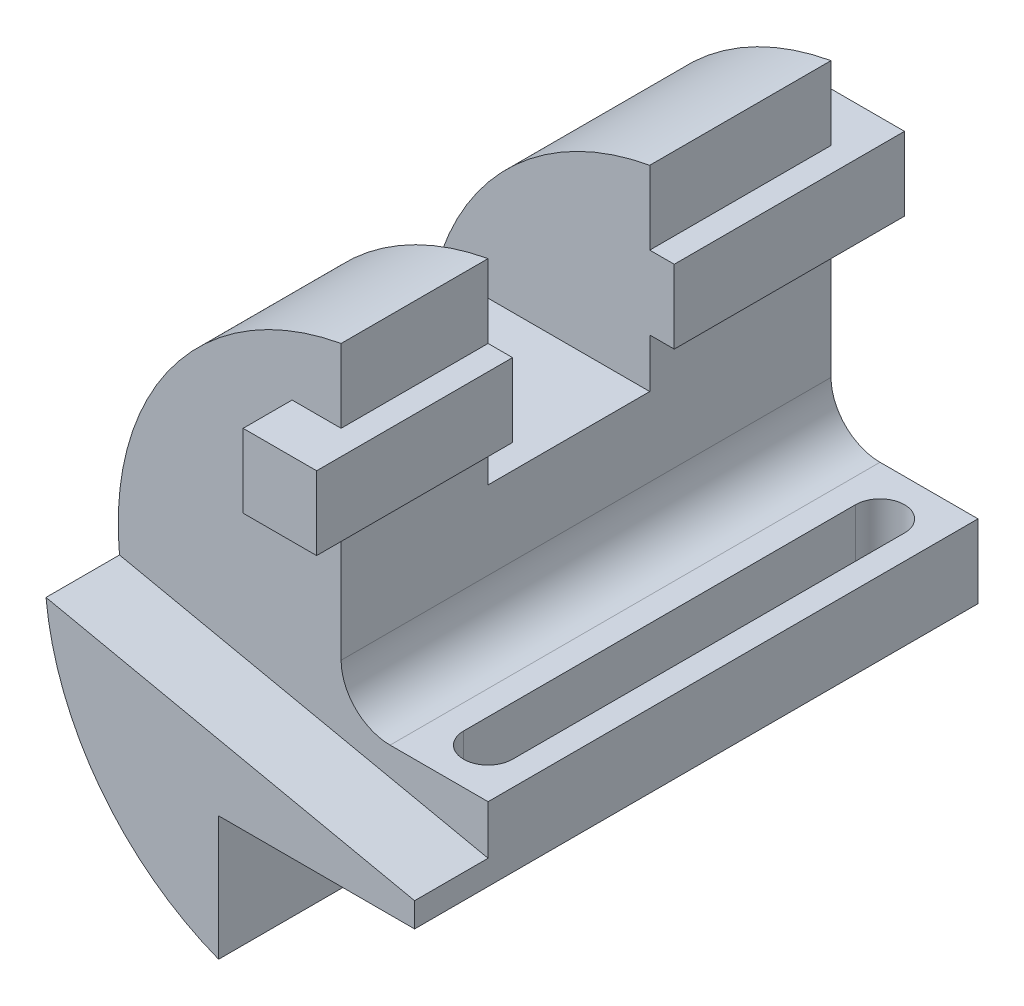
ISO-10303-21;
HEADER;
FILE_DESCRIPTION(('STEP AP214'),'2;1');
FILE_NAME('part.step','',(''),(''),'','','');
FILE_SCHEMA(('AUTOMOTIVE_DESIGN { 1 0 10303 214 1 1 1 1 }'));
ENDSEC;
DATA;
#1=APPLICATION_CONTEXT('core data for automotive mechanical design processes');
#2=APPLICATION_PROTOCOL_DEFINITION('international standard','automotive_design',2000,#1);
#3=PRODUCT_CONTEXT('',#1,'mechanical');
#4=PRODUCT('Part','Part','',(#3));
#5=PRODUCT_RELATED_PRODUCT_CATEGORY('part','',(#4));
#6=PRODUCT_DEFINITION_FORMATION('','',#4);
#7=PRODUCT_DEFINITION_CONTEXT('part definition',#1,'design');
#8=PRODUCT_DEFINITION('design','',#6,#7);
#9=PRODUCT_DEFINITION_SHAPE('','',#8);
#10=(LENGTH_UNIT() NAMED_UNIT(*) SI_UNIT(.MILLI.,.METRE.));
#11=(NAMED_UNIT(*) PLANE_ANGLE_UNIT() SI_UNIT($,.RADIAN.));
#12=(NAMED_UNIT(*) SI_UNIT($,.STERADIAN.) SOLID_ANGLE_UNIT());
#13=UNCERTAINTY_MEASURE_WITH_UNIT(LENGTH_MEASURE(1.E-05),#10,'distance_accuracy_value','');
#14=(GEOMETRIC_REPRESENTATION_CONTEXT(3) GLOBAL_UNCERTAINTY_ASSIGNED_CONTEXT((#13)) GLOBAL_UNIT_ASSIGNED_CONTEXT((#10,
#11,#12)) REPRESENTATION_CONTEXT('',''));
#15=CARTESIAN_POINT('',(0.,0.,0.));
#16=DIRECTION('',(0.,0.,1.));
#17=DIRECTION('',(1.,0.,0.));
#18=AXIS2_PLACEMENT_3D('',#15,#16,#17);
#19=CARTESIAN_POINT('',(-9.99999999999997,0.,-115.));
#20=DIRECTION('',(-1.,0.,0.));
#21=DIRECTION('',(0.,-1.,0.));
#22=AXIS2_PLACEMENT_3D('',#19,#20,#21);
#23=PLANE('',#22);
#24=DIRECTION('',(0.,0.,1.));
#25=VECTOR('',#24,1.);
#26=CARTESIAN_POINT('',(-9.99999999999997,91.362796982157,-115.));
#27=LINE('',#26,#25);
#28=CARTESIAN_POINT('',(-9.99999999999997,91.362796982157,-45.));
#29=VERTEX_POINT('',#28);
#30=CARTESIAN_POINT('',(-9.99999999999997,91.3627969821569,-15.));
#31=VERTEX_POINT('',#30);
#32=EDGE_CURVE('E385',#29,#31,#27,.T.);
#33=ORIENTED_EDGE('',*,*,#32,.F.);
#34=DIRECTION('',(0.,1.,0.));
#35=VECTOR('',#34,1.);
#36=CARTESIAN_POINT('',(-9.99999999999997,0.,-45.));
#37=LINE('',#36,#35);
#38=CARTESIAN_POINT('',(-9.99999999999996,106.362796982157,-45.));
#39=VERTEX_POINT('',#38);
#40=EDGE_CURVE('E315',#29,#39,#37,.T.);
#41=ORIENTED_EDGE('',*,*,#40,.T.);
#42=DIRECTION('',(0.,0.,1.));
#43=VECTOR('',#42,1.);
#44=CARTESIAN_POINT('',(-9.99999999999997,106.362796982157,-115.));
#45=LINE('',#44,#43);
#46=CARTESIAN_POINT('',(-9.99999999999997,106.362796982157,-15.));
#47=VERTEX_POINT('',#46);
#48=EDGE_CURVE('E452',#39,#47,#45,.T.);
#49=ORIENTED_EDGE('',*,*,#48,.T.);
#50=DIRECTION('',(0.,-1.,0.));
#51=VECTOR('',#50,1.);
#52=CARTESIAN_POINT('',(-9.99999999999997,0.,-15.));
#53=LINE('',#52,#51);
#54=EDGE_CURVE('E394',#47,#31,#53,.T.);
#55=ORIENTED_EDGE('',*,*,#54,.T.);
#56=EDGE_LOOP('',(#33,#41,#49,#55));
#57=FACE_BOUND('',#56,.T.);
#58=ADVANCED_FACE('F43',(#57),#23,.F.);
#59=CARTESIAN_POINT('',(-4.99999999999997,91.362796982157,26.2132034355964));
#60=DIRECTION('',(0.,-1.,0.));
#61=DIRECTION('',(1.,0.,0.));
#62=AXIS2_PLACEMENT_3D('',#59,#60,#61);
#63=PLANE('',#62);
#64=DIRECTION('',(0.,0.,-1.));
#65=VECTOR('',#64,1.);
#66=CARTESIAN_POINT('',(-4.99999999999997,91.362796982157,26.2132034355964));
#67=LINE('',#66,#65);
#68=CARTESIAN_POINT('',(-4.99999999999997,91.362796982157,-5.));
#69=VERTEX_POINT('',#68);
#70=CARTESIAN_POINT('',(-4.99999999999997,91.362796982157,-45.));
#71=VERTEX_POINT('',#70);
#72=EDGE_CURVE('E358',#69,#71,#67,.T.);
#73=ORIENTED_EDGE('',*,*,#72,.T.);
#74=DIRECTION('',(-1.,0.,0.));
#75=VECTOR('',#74,1.);
#76=CARTESIAN_POINT('',(-4.99999999999997,91.362796982157,-45.));
#77=LINE('',#76,#75);
#78=EDGE_CURVE('E311',#71,#29,#77,.T.);
#79=ORIENTED_EDGE('',*,*,#78,.T.);
#80=ORIENTED_EDGE('',*,*,#32,.T.);
#81=DIRECTION('',(1.,0.,0.));
#82=VECTOR('',#81,1.);
#83=CARTESIAN_POINT('',(0.,91.362796982157,-15.));
#84=LINE('',#83,#82);
#85=CARTESIAN_POINT('',(-20.,91.3627969821569,-15.));
#86=VERTEX_POINT('',#85);
#87=EDGE_CURVE('E501',#86,#31,#84,.T.);
#88=ORIENTED_EDGE('',*,*,#87,.F.);
#89=DIRECTION('',(0.,0.,-1.));
#90=VECTOR('',#89,1.);
#91=CARTESIAN_POINT('',(-20.,91.3627969821569,26.2132034355964));
#92=LINE('',#91,#90);
#93=CARTESIAN_POINT('',(-20.,91.3627969821569,-5.));
#94=VERTEX_POINT('',#93);
#95=EDGE_CURVE('E364',#94,#86,#92,.T.);
#96=ORIENTED_EDGE('',*,*,#95,.F.);
#97=DIRECTION('',(-1.,0.,0.));
#98=VECTOR('',#97,1.);
#99=CARTESIAN_POINT('',(-4.99999999999997,91.362796982157,-5.));
#100=LINE('',#99,#98);
#101=EDGE_CURVE('E345',#69,#94,#100,.T.);
#102=ORIENTED_EDGE('',*,*,#101,.F.);
#103=EDGE_LOOP('',(#73,#79,#80,#88,#96,#102));
#104=FACE_BOUND('',#103,.T.);
#105=ADVANCED_FACE('F548',(#104),#63,.F.);
#106=CARTESIAN_POINT('',(-4.99999999999997,76.362796982157,26.2132034355964));
#107=DIRECTION('',(0.,1.,0.));
#108=DIRECTION('',(0.,0.,1.));
#109=AXIS2_PLACEMENT_3D('',#106,#107,#108);
#110=PLANE('',#109);
#111=DIRECTION('',(0.,0.,-1.));
#112=VECTOR('',#111,1.);
#113=CARTESIAN_POINT('',(-9.99999999999997,76.362796982157,-115.));
#114=LINE('',#113,#112);
#115=CARTESIAN_POINT('',(-9.99999999999997,76.362796982157,-15.));
#116=VERTEX_POINT('',#115);
#117=CARTESIAN_POINT('',(-9.99999999999997,76.362796982157,-45.));
#118=VERTEX_POINT('',#117);
#119=EDGE_CURVE('E375',#116,#118,#114,.T.);
#120=ORIENTED_EDGE('',*,*,#119,.T.);
#121=DIRECTION('',(1.,0.,0.));
#122=VECTOR('',#121,1.);
#123=CARTESIAN_POINT('',(-4.99999999999997,76.362796982157,-45.));
#124=LINE('',#123,#122);
#125=CARTESIAN_POINT('',(-4.99999999999997,76.362796982157,-45.));
#126=VERTEX_POINT('',#125);
#127=EDGE_CURVE('E303',#118,#126,#124,.T.);
#128=ORIENTED_EDGE('',*,*,#127,.T.);
#129=DIRECTION('',(0.,0.,-1.));
#130=VECTOR('',#129,1.);
#131=CARTESIAN_POINT('',(-4.99999999999997,76.362796982157,26.2132034355964));
#132=LINE('',#131,#130);
#133=CARTESIAN_POINT('',(-4.99999999999997,76.362796982157,-5.));
#134=VERTEX_POINT('',#133);
#135=EDGE_CURVE('E371',#134,#126,#132,.T.);
#136=ORIENTED_EDGE('',*,*,#135,.F.);
#137=DIRECTION('',(1.,0.,0.));
#138=VECTOR('',#137,1.);
#139=CARTESIAN_POINT('',(-4.99999999999997,76.362796982157,-5.));
#140=LINE('',#139,#138);
#141=CARTESIAN_POINT('',(-20.,76.362796982157,-5.));
#142=VERTEX_POINT('',#141);
#143=EDGE_CURVE('E353',#142,#134,#140,.T.);
#144=ORIENTED_EDGE('',*,*,#143,.F.);
#145=DIRECTION('',(0.,0.,-1.));
#146=VECTOR('',#145,1.);
#147=CARTESIAN_POINT('',(-20.,76.362796982157,26.2132034355964));
#148=LINE('',#147,#146);
#149=CARTESIAN_POINT('',(-20.,76.362796982157,-15.));
#150=VERTEX_POINT('',#149);
#151=EDGE_CURVE('E357',#142,#150,#148,.T.);
#152=ORIENTED_EDGE('',*,*,#151,.T.);
#153=DIRECTION('',(-1.,0.,0.));
#154=VECTOR('',#153,1.);
#155=CARTESIAN_POINT('',(0.,76.362796982157,-15.));
#156=LINE('',#155,#154);
#157=EDGE_CURVE('E469',#116,#150,#156,.T.);
#158=ORIENTED_EDGE('',*,*,#157,.F.);
#159=EDGE_LOOP('',(#120,#128,#136,#144,#152,#158));
#160=FACE_BOUND('',#159,.T.);
#161=ADVANCED_FACE('F554',(#160),#110,.F.);
#162=CARTESIAN_POINT('',(-4.99999999999997,91.362796982157,26.2132034355964));
#163=DIRECTION('',(-1.,0.,0.));
#164=DIRECTION('',(0.,-1.,0.));
#165=AXIS2_PLACEMENT_3D('',#162,#163,#164);
#166=PLANE('',#165);
#167=ORIENTED_EDGE('',*,*,#135,.T.);
#168=DIRECTION('',(0.,1.,0.));
#169=VECTOR('',#168,1.);
#170=CARTESIAN_POINT('',(-4.99999999999997,91.362796982157,-45.));
#171=LINE('',#170,#169);
#172=EDGE_CURVE('E12',#126,#71,#171,.T.);
#173=ORIENTED_EDGE('',*,*,#172,.T.);
#174=ORIENTED_EDGE('',*,*,#72,.F.);
#175=DIRECTION('',(0.,1.,0.));
#176=VECTOR('',#175,1.);
#177=CARTESIAN_POINT('',(-4.99999999999997,91.362796982157,-5.));
#178=LINE('',#177,#176);
#179=EDGE_CURVE('E349',#134,#69,#178,.T.);
#180=ORIENTED_EDGE('',*,*,#179,.F.);
#181=EDGE_LOOP('',(#167,#173,#174,#180));
#182=FACE_BOUND('',#181,.T.);
#183=ADVANCED_FACE('F563',(#182),#166,.F.);
#184=CARTESIAN_POINT('',(-9.99999999999997,106.362796982157,-115.));
#185=VERTEX_POINT('',#184);
#186=CARTESIAN_POINT('',(-10.,106.362796982157,-78.));
#187=VERTEX_POINT('',#186);
#188=EDGE_CURVE('E490',#185,#187,#45,.T.);
#189=ORIENTED_EDGE('',*,*,#188,.T.);
#190=DIRECTION('',(0.,-1.,0.));
#191=VECTOR('',#190,1.);
#192=CARTESIAN_POINT('',(-9.99999999999997,0.,-78.));
#193=LINE('',#192,#191);
#194=CARTESIAN_POINT('',(-9.99999999999997,91.362796982157,-78.));
#195=VERTEX_POINT('',#194);
#196=EDGE_CURVE('E299',#187,#195,#193,.T.);
#197=ORIENTED_EDGE('',*,*,#196,.T.);
#198=CARTESIAN_POINT('',(-9.99999999999997,91.362796982157,-115.));
#199=VERTEX_POINT('',#198);
#200=EDGE_CURVE('E386',#199,#195,#27,.T.);
#201=ORIENTED_EDGE('',*,*,#200,.F.);
#202=DIRECTION('',(0.,-1.,0.));
#203=VECTOR('',#202,1.);
#204=CARTESIAN_POINT('',(-9.99999999999997,0.,-115.));
#205=LINE('',#204,#203);
#206=EDGE_CURVE('E429',#185,#199,#205,.T.);
#207=ORIENTED_EDGE('',*,*,#206,.F.);
#208=EDGE_LOOP('',(#189,#197,#201,#207));
#209=FACE_BOUND('',#208,.T.);
#210=ADVANCED_FACE('F45',(#209),#23,.F.);
#211=DIRECTION('',(0.,0.,1.));
#212=VECTOR('',#211,1.);
#213=CARTESIAN_POINT('',(-9.99999999999997,66.3627969821569,-115.));
#214=LINE('',#213,#212);
#215=CARTESIAN_POINT('',(-9.99999999999997,66.362796982157,-78.));
#216=VERTEX_POINT('',#215);
#217=CARTESIAN_POINT('',(-9.99999999999997,66.362796982157,-45.));
#218=VERTEX_POINT('',#217);
#219=EDGE_CURVE('E319',#216,#218,#214,.T.);
#220=ORIENTED_EDGE('',*,*,#219,.T.);
#221=DIRECTION('',(0.,1.,0.));
#222=VECTOR('',#221,1.);
#223=CARTESIAN_POINT('',(-9.99999999999997,0.,-45.));
#224=LINE('',#223,#222);
#225=EDGE_CURVE('E307',#218,#118,#224,.T.);
#226=ORIENTED_EDGE('',*,*,#225,.T.);
#227=ORIENTED_EDGE('',*,*,#119,.F.);
#228=CARTESIAN_POINT('',(-9.99999999999997,50.362796982157,-15.));
#229=VERTEX_POINT('',#228);
#230=EDGE_CURVE('E399',#116,#229,#53,.T.);
#231=ORIENTED_EDGE('',*,*,#230,.T.);
#232=DIRECTION('',(0.,0.,1.));
#233=VECTOR('',#232,1.);
#234=CARTESIAN_POINT('',(-9.99999999999997,50.362796982157,-115.));
#235=LINE('',#234,#233);
#236=CARTESIAN_POINT('',(-9.99999999999997,50.362796982157,-115.));
#237=VERTEX_POINT('',#236);
#238=EDGE_CURVE('E465',#237,#229,#235,.T.);
#239=ORIENTED_EDGE('',*,*,#238,.F.);
#240=CARTESIAN_POINT('',(-9.99999999999997,76.362796982157,-115.));
#241=VERTEX_POINT('',#240);
#242=EDGE_CURVE('E434',#241,#237,#205,.T.);
#243=ORIENTED_EDGE('',*,*,#242,.F.);
#244=CARTESIAN_POINT('',(-9.99999999999997,76.362796982157,-78.));
#245=VERTEX_POINT('',#244);
#246=EDGE_CURVE('E344',#245,#241,#114,.T.);
#247=ORIENTED_EDGE('',*,*,#246,.F.);
#248=DIRECTION('',(0.,-1.,0.));
#249=VECTOR('',#248,1.);
#250=CARTESIAN_POINT('',(-9.99999999999997,0.,-78.));
#251=LINE('',#250,#249);
#252=EDGE_CURVE('E291',#245,#216,#251,.T.);
#253=ORIENTED_EDGE('',*,*,#252,.T.);
#254=EDGE_LOOP('',(#220,#226,#227,#231,#239,#243,#247,#253));
#255=FACE_BOUND('',#254,.T.);
#256=ADVANCED_FACE('F550',(#255),#23,.F.);
#257=CARTESIAN_POINT('',(0.,0.,-115.));
#258=DIRECTION('',(0.,0.,1.));
#259=DIRECTION('',(1.,0.,0.));
#260=AXIS2_PLACEMENT_3D('',#257,#258,#259);
#261=PLANE('',#260);
#262=DIRECTION('',(1.,0.,0.));
#263=VECTOR('',#262,1.);
#264=CARTESIAN_POINT('',(0.,91.362796982157,-115.));
#265=LINE('',#264,#263);
#266=CARTESIAN_POINT('',(-20.,91.3627969821569,-115.));
#267=VERTEX_POINT('',#266);
#268=EDGE_CURVE('E390',#267,#199,#265,.T.);
#269=ORIENTED_EDGE('',*,*,#268,.F.);
#270=DIRECTION('',(0.,1.,0.));
#271=VECTOR('',#270,1.);
#272=CARTESIAN_POINT('',(-20.,0.,-115.));
#273=LINE('',#272,#271);
#274=CARTESIAN_POINT('',(-20.,76.362796982157,-115.));
#275=VERTEX_POINT('',#274);
#276=EDGE_CURVE('E382',#275,#267,#273,.T.);
#277=ORIENTED_EDGE('',*,*,#276,.F.);
#278=DIRECTION('',(-1.,0.,0.));
#279=VECTOR('',#278,1.);
#280=CARTESIAN_POINT('',(0.,76.362796982157,-115.));
#281=LINE('',#280,#279);
#282=EDGE_CURVE('E379',#241,#275,#281,.T.);
#283=ORIENTED_EDGE('',*,*,#282,.F.);
#284=ORIENTED_EDGE('',*,*,#242,.T.);
#285=CARTESIAN_POINT('',(0.,50.362796982157,-115.));
#286=DIRECTION('',(0.,0.,1.));
#287=DIRECTION('',(1.,0.,0.));
#288=AXIS2_PLACEMENT_3D('',#285,#286,#287);
#289=CIRCLE('',#288,10.);
#290=CARTESIAN_POINT('',(0.,40.3627969821569,-115.));
#291=VERTEX_POINT('',#290);
#292=EDGE_CURVE('E449',#237,#291,#289,.T.);
#293=ORIENTED_EDGE('',*,*,#292,.T.);
#294=DIRECTION('',(1.,0.,0.));
#295=VECTOR('',#294,1.);
#296=CARTESIAN_POINT('',(0.,40.3627969821569,-115.));
#297=LINE('',#296,#295);
#298=CARTESIAN_POINT('',(20.,40.3627969821569,-115.));
#299=VERTEX_POINT('',#298);
#300=EDGE_CURVE('E446',#291,#299,#297,.T.);
#301=ORIENTED_EDGE('',*,*,#300,.T.);
#302=DIRECTION('',(0.,-1.,0.));
#303=VECTOR('',#302,1.);
#304=CARTESIAN_POINT('',(20.,0.,-115.));
#305=LINE('',#304,#303);
#306=CARTESIAN_POINT('',(20.,25.3627969821569,-115.));
#307=VERTEX_POINT('',#306);
#308=EDGE_CURVE('E443',#299,#307,#305,.T.);
#309=ORIENTED_EDGE('',*,*,#308,.T.);
#310=DIRECTION('',(-1.,0.,0.));
#311=VECTOR('',#310,1.);
#312=CARTESIAN_POINT('',(0.,25.362796982157,-115.));
#313=LINE('',#312,#311);
#314=CARTESIAN_POINT('',(-20.,25.362796982157,-115.));
#315=VERTEX_POINT('',#314);
#316=EDGE_CURVE('E440',#307,#315,#313,.T.);
#317=ORIENTED_EDGE('',*,*,#316,.T.);
#318=DIRECTION('',(0.,-1.,0.));
#319=VECTOR('',#318,1.);
#320=CARTESIAN_POINT('',(-20.,0.,-115.));
#321=LINE('',#320,#319);
#322=CARTESIAN_POINT('',(-20.,0.,-115.));
#323=VERTEX_POINT('',#322);
#324=EDGE_CURVE('E437',#315,#323,#321,.T.);
#325=ORIENTED_EDGE('',*,*,#324,.T.);
#326=CARTESIAN_POINT('',(0.,51.7711309515255,-115.));
#327=DIRECTION('',(0.,0.,1.));
#328=DIRECTION('',(1.,0.,0.));
#329=AXIS2_PLACEMENT_3D('',#326,#327,#328);
#330=CIRCLE('',#329,55.5);
#331=EDGE_CURVE('E433',#323,#185,#330,.F.);
#332=ORIENTED_EDGE('',*,*,#331,.T.);
#333=ORIENTED_EDGE('',*,*,#206,.T.);
#334=EDGE_LOOP('',(#269,#277,#283,#284,#293,#301,#309,#317,#325,#332,#333));
#335=FACE_BOUND('',#334,.T.);
#336=ADVANCED_FACE('F560',(#335),#261,.F.);
#337=CARTESIAN_POINT('',(0.,0.,-15.));
#338=DIRECTION('',(0.,0.,1.));
#339=DIRECTION('',(1.,0.,0.));
#340=AXIS2_PLACEMENT_3D('',#337,#338,#339);
#341=PLANE('',#340);
#342=DIRECTION('',(0.,1.,0.));
#343=VECTOR('',#342,1.);
#344=CARTESIAN_POINT('',(-20.,0.,-15.));
#345=LINE('',#344,#343);
#346=EDGE_CURVE('E497',#150,#86,#345,.T.);
#347=ORIENTED_EDGE('',*,*,#346,.T.);
#348=ORIENTED_EDGE('',*,*,#87,.T.);
#349=ORIENTED_EDGE('',*,*,#54,.F.);
#350=CARTESIAN_POINT('',(0.,51.7711309515255,-15.));
#351=DIRECTION('',(0.,0.,1.));
#352=DIRECTION('',(1.,0.,0.));
#353=AXIS2_PLACEMENT_3D('',#350,#351,#352);
#354=CIRCLE('',#353,55.5);
#355=CARTESIAN_POINT('',(-55.2350441418964,46.3544992820505,-15.));
#356=VERTEX_POINT('',#355);
#357=EDGE_CURVE('E398',#356,#47,#354,.F.);
#358=ORIENTED_EDGE('',*,*,#357,.F.);
#359=DIRECTION('',(0.978147600733806,-0.207911690817756,0.));
#360=VECTOR('',#359,1.);
#361=CARTESIAN_POINT('',(7.03937648303113,33.1176625540234,-15.));
#362=LINE('',#361,#360);
#363=CARTESIAN_POINT('',(20.,30.362796982157,-15.));
#364=VERTEX_POINT('',#363);
#365=EDGE_CURVE('E403',#356,#364,#362,.T.);
#366=ORIENTED_EDGE('',*,*,#365,.T.);
#367=DIRECTION('',(0.,-1.,0.));
#368=VECTOR('',#367,1.);
#369=CARTESIAN_POINT('',(20.,0.,-15.));
#370=LINE('',#369,#368);
#371=CARTESIAN_POINT('',(20.,40.3627969821569,-15.));
#372=VERTEX_POINT('',#371);
#373=EDGE_CURVE('E407',#372,#364,#370,.T.);
#374=ORIENTED_EDGE('',*,*,#373,.F.);
#375=DIRECTION('',(1.,0.,0.));
#376=VECTOR('',#375,1.);
#377=CARTESIAN_POINT('',(0.,40.3627969821569,-15.));
#378=LINE('',#377,#376);
#379=CARTESIAN_POINT('',(0.,40.3627969821569,-15.));
#380=VERTEX_POINT('',#379);
#381=EDGE_CURVE('E411',#380,#372,#378,.T.);
#382=ORIENTED_EDGE('',*,*,#381,.F.);
#383=CARTESIAN_POINT('',(0.,50.362796982157,-15.));
#384=DIRECTION('',(0.,0.,1.));
#385=DIRECTION('',(1.,0.,0.));
#386=AXIS2_PLACEMENT_3D('',#383,#384,#385);
#387=CIRCLE('',#386,10.);
#388=EDGE_CURVE('E415',#229,#380,#387,.T.);
#389=ORIENTED_EDGE('',*,*,#388,.F.);
#390=ORIENTED_EDGE('',*,*,#230,.F.);
#391=ORIENTED_EDGE('',*,*,#157,.T.);
#392=EDGE_LOOP('',(#347,#348,#349,#358,#366,#374,#382,#389,#390,#391));
#393=FACE_BOUND('',#392,.T.);
#394=ADVANCED_FACE('F609',(#393),#341,.T.);
#395=CARTESIAN_POINT('',(0.,50.362796982157,-115.));
#396=DIRECTION('',(0.,0.,1.));
#397=DIRECTION('',(1.,0.,0.));
#398=AXIS2_PLACEMENT_3D('',#395,#396,#397);
#399=CYLINDRICAL_SURFACE('',#398,10.);
#400=ORIENTED_EDGE('',*,*,#388,.T.);
#401=DIRECTION('',(0.,0.,1.));
#402=VECTOR('',#401,1.);
#403=CARTESIAN_POINT('',(0.,40.3627969821569,-115.));
#404=LINE('',#403,#402);
#405=EDGE_CURVE('E470',#291,#380,#404,.T.);
#406=ORIENTED_EDGE('',*,*,#405,.F.);
#407=ORIENTED_EDGE('',*,*,#292,.F.);
#408=ORIENTED_EDGE('',*,*,#238,.T.);
#409=EDGE_LOOP('',(#400,#406,#407,#408));
#410=FACE_BOUND('',#409,.T.);
#411=ADVANCED_FACE('F615',(#410),#399,.F.);
#412=CARTESIAN_POINT('',(0.,40.3627969821569,-115.));
#413=DIRECTION('',(0.,-1.,0.));
#414=DIRECTION('',(0.,0.,-1.));
#415=AXIS2_PLACEMENT_3D('',#412,#413,#414);
#416=PLANE('',#415);
#417=DIRECTION('',(0.,0.,-1.));
#418=VECTOR('',#417,1.);
#419=CARTESIAN_POINT('',(15.,40.3627969821569,-25.));
#420=LINE('',#419,#418);
#421=CARTESIAN_POINT('',(15.,40.3627969821569,-25.));
#422=VERTEX_POINT('',#421);
#423=CARTESIAN_POINT('',(15.,40.3627969821569,-105.));
#424=VERTEX_POINT('',#423);
#425=EDGE_CURVE('E242',#422,#424,#420,.T.);
#426=ORIENTED_EDGE('',*,*,#425,.F.);
#427=CARTESIAN_POINT('',(9.99999999999997,40.3627969821569,-25.));
#428=DIRECTION('',(0.,1.,0.));
#429=DIRECTION('',(0.,0.,1.));
#430=AXIS2_PLACEMENT_3D('',#427,#428,#429);
#431=CIRCLE('',#430,5.);
#432=CARTESIAN_POINT('',(4.99999999999996,40.3627969821569,-25.));
#433=VERTEX_POINT('',#432);
#434=EDGE_CURVE('E59',#433,#422,#431,.T.);
#435=ORIENTED_EDGE('',*,*,#434,.F.);
#436=DIRECTION('',(0.,0.,1.));
#437=VECTOR('',#436,1.);
#438=CARTESIAN_POINT('',(4.99999999999996,40.3627969821569,-25.));
#439=LINE('',#438,#437);
#440=CARTESIAN_POINT('',(4.99999999999996,40.3627969821569,-105.));
#441=VERTEX_POINT('',#440);
#442=EDGE_CURVE('E250',#441,#433,#439,.T.);
#443=ORIENTED_EDGE('',*,*,#442,.F.);
#444=CARTESIAN_POINT('',(9.99999999999996,40.3627969821569,-105.));
#445=DIRECTION('',(0.,1.,0.));
#446=DIRECTION('',(0.,0.,1.));
#447=AXIS2_PLACEMENT_3D('',#444,#445,#446);
#448=CIRCLE('',#447,5.);
#449=EDGE_CURVE('E232',#424,#441,#448,.T.);
#450=ORIENTED_EDGE('',*,*,#449,.F.);
#451=EDGE_LOOP('',(#426,#435,#443,#450));
#452=FACE_BOUND('',#451,.T.);
#453=ORIENTED_EDGE('',*,*,#381,.T.);
#454=DIRECTION('',(0.,0.,1.));
#455=VECTOR('',#454,1.);
#456=CARTESIAN_POINT('',(20.,40.3627969821569,-115.));
#457=LINE('',#456,#455);
#458=EDGE_CURVE('E474',#299,#372,#457,.T.);
#459=ORIENTED_EDGE('',*,*,#458,.F.);
#460=ORIENTED_EDGE('',*,*,#300,.F.);
#461=ORIENTED_EDGE('',*,*,#405,.T.);
#462=EDGE_LOOP('',(#453,#459,#460,#461));
#463=FACE_BOUND('',#462,.T.);
#464=ADVANCED_FACE('F247',(#452,#463),#416,.F.);
#465=CARTESIAN_POINT('',(20.,0.,-115.));
#466=DIRECTION('',(-1.,0.,0.));
#467=DIRECTION('',(0.,-1.,0.));
#468=AXIS2_PLACEMENT_3D('',#465,#466,#467);
#469=PLANE('',#468);
#470=ORIENTED_EDGE('',*,*,#373,.T.);
#471=DIRECTION('',(0.,0.,1.));
#472=VECTOR('',#471,1.);
#473=CARTESIAN_POINT('',(20.,30.362796982157,-15.));
#474=LINE('',#473,#472);
#475=CARTESIAN_POINT('',(20.,30.362796982157,0.));
#476=VERTEX_POINT('',#475);
#477=EDGE_CURVE('E422',#364,#476,#474,.T.);
#478=ORIENTED_EDGE('',*,*,#477,.T.);
#479=DIRECTION('',(0.,-1.,0.));
#480=VECTOR('',#479,1.);
#481=CARTESIAN_POINT('',(20.,0.,0.));
#482=LINE('',#481,#480);
#483=CARTESIAN_POINT('',(20.,25.3627969821569,0.));
#484=VERTEX_POINT('',#483);
#485=EDGE_CURVE('E462',#476,#484,#482,.T.);
#486=ORIENTED_EDGE('',*,*,#485,.T.);
#487=DIRECTION('',(0.,0.,1.));
#488=VECTOR('',#487,1.);
#489=CARTESIAN_POINT('',(20.,25.3627969821569,-115.));
#490=LINE('',#489,#488);
#491=EDGE_CURVE('E478',#307,#484,#490,.T.);
#492=ORIENTED_EDGE('',*,*,#491,.F.);
#493=ORIENTED_EDGE('',*,*,#308,.F.);
#494=ORIENTED_EDGE('',*,*,#458,.T.);
#495=EDGE_LOOP('',(#470,#478,#486,#492,#493,#494));
#496=FACE_BOUND('',#495,.T.);
#497=ADVANCED_FACE('F604',(#496),#469,.F.);
#498=CARTESIAN_POINT('',(0.,25.362796982157,-115.));
#499=DIRECTION('',(0.,1.,0.));
#500=DIRECTION('',(-1.,0.,0.));
#501=AXIS2_PLACEMENT_3D('',#498,#499,#500);
#502=PLANE('',#501);
#503=DIRECTION('',(0.,0.,-1.));
#504=VECTOR('',#503,1.);
#505=CARTESIAN_POINT('',(4.99999999999996,25.3627969821569,-25.));
#506=LINE('',#505,#504);
#507=CARTESIAN_POINT('',(4.99999999999996,25.3627969821569,-25.));
#508=VERTEX_POINT('',#507);
#509=CARTESIAN_POINT('',(4.99999999999996,25.3627969821569,-105.));
#510=VERTEX_POINT('',#509);
#511=EDGE_CURVE('E520',#508,#510,#506,.T.);
#512=ORIENTED_EDGE('',*,*,#511,.F.);
#513=CARTESIAN_POINT('',(9.99999999999997,25.3627969821569,-25.));
#514=DIRECTION('',(0.,1.,0.));
#515=DIRECTION('',(-1.,0.,0.));
#516=AXIS2_PLACEMENT_3D('',#513,#514,#515);
#517=CIRCLE('',#516,5.);
#518=CARTESIAN_POINT('',(15.,25.3627969821569,-25.));
#519=VERTEX_POINT('',#518);
#520=EDGE_CURVE('E268',#519,#508,#517,.F.);
#521=ORIENTED_EDGE('',*,*,#520,.F.);
#522=DIRECTION('',(0.,0.,1.));
#523=VECTOR('',#522,1.);
#524=CARTESIAN_POINT('',(15.,25.3627969821569,-25.));
#525=LINE('',#524,#523);
#526=CARTESIAN_POINT('',(15.,25.3627969821569,-105.));
#527=VERTEX_POINT('',#526);
#528=EDGE_CURVE('E264',#527,#519,#525,.T.);
#529=ORIENTED_EDGE('',*,*,#528,.F.);
#530=CARTESIAN_POINT('',(9.99999999999996,25.3627969821569,-105.));
#531=DIRECTION('',(0.,1.,0.));
#532=DIRECTION('',(-1.,0.,0.));
#533=AXIS2_PLACEMENT_3D('',#530,#531,#532);
#534=CIRCLE('',#533,5.);
#535=EDGE_CURVE('E235',#510,#527,#534,.F.);
#536=ORIENTED_EDGE('',*,*,#535,.F.);
#537=EDGE_LOOP('',(#512,#521,#529,#536));
#538=FACE_BOUND('',#537,.T.);
#539=DIRECTION('',(-1.,0.,0.));
#540=VECTOR('',#539,1.);
#541=CARTESIAN_POINT('',(0.,25.362796982157,0.));
#542=LINE('',#541,#540);
#543=CARTESIAN_POINT('',(-20.,25.362796982157,0.));
#544=VERTEX_POINT('',#543);
#545=EDGE_CURVE('E459',#484,#544,#542,.T.);
#546=ORIENTED_EDGE('',*,*,#545,.T.);
#547=DIRECTION('',(0.,0.,1.));
#548=VECTOR('',#547,1.);
#549=CARTESIAN_POINT('',(-20.,25.362796982157,-115.));
#550=LINE('',#549,#548);
#551=EDGE_CURVE('E482',#315,#544,#550,.T.);
#552=ORIENTED_EDGE('',*,*,#551,.F.);
#553=ORIENTED_EDGE('',*,*,#316,.F.);
#554=ORIENTED_EDGE('',*,*,#491,.T.);
#555=EDGE_LOOP('',(#546,#552,#553,#554));
#556=FACE_BOUND('',#555,.T.);
#557=ADVANCED_FACE('F532',(#538,#556),#502,.F.);
#558=CARTESIAN_POINT('',(-20.,0.,-115.));
#559=DIRECTION('',(-1.,0.,0.));
#560=DIRECTION('',(0.,-1.,0.));
#561=AXIS2_PLACEMENT_3D('',#558,#559,#560);
#562=PLANE('',#561);
#563=DIRECTION('',(0.,-1.,0.));
#564=VECTOR('',#563,1.);
#565=CARTESIAN_POINT('',(-20.,0.,0.));
#566=LINE('',#565,#564);
#567=CARTESIAN_POINT('',(-20.,0.,0.));
#568=VERTEX_POINT('',#567);
#569=EDGE_CURVE('E456',#544,#568,#566,.T.);
#570=ORIENTED_EDGE('',*,*,#569,.T.);
#571=DIRECTION('',(0.,0.,1.));
#572=VECTOR('',#571,1.);
#573=CARTESIAN_POINT('',(-20.,0.,-115.));
#574=LINE('',#573,#572);
#575=EDGE_CURVE('E486',#323,#568,#574,.T.);
#576=ORIENTED_EDGE('',*,*,#575,.F.);
#577=ORIENTED_EDGE('',*,*,#324,.F.);
#578=ORIENTED_EDGE('',*,*,#551,.T.);
#579=EDGE_LOOP('',(#570,#576,#577,#578));
#580=FACE_BOUND('',#579,.T.);
#581=ADVANCED_FACE('F591',(#580),#562,.F.);
#582=CARTESIAN_POINT('',(0.,51.7711309515255,-115.));
#583=DIRECTION('',(0.,0.,1.));
#584=DIRECTION('',(1.,0.,0.));
#585=AXIS2_PLACEMENT_3D('',#582,#583,#584);
#586=CYLINDRICAL_SURFACE('',#585,55.5);
#587=ORIENTED_EDGE('',*,*,#48,.F.);
#588=CARTESIAN_POINT('',(0.,51.7711309515255,-45.));
#589=DIRECTION('',(0.,0.,1.));
#590=DIRECTION('',(0.,-1.,0.));
#591=AXIS2_PLACEMENT_3D('',#588,#589,#590);
#592=CIRCLE('',#591,55.5);
#593=CARTESIAN_POINT('',(-53.5474862383895,66.3627969821569,-45.));
#594=VERTEX_POINT('',#593);
#595=EDGE_CURVE('E274',#594,#39,#592,.F.);
#596=ORIENTED_EDGE('',*,*,#595,.F.);
#597=DIRECTION('',(0.,0.,1.));
#598=VECTOR('',#597,1.);
#599=CARTESIAN_POINT('',(-53.5474862383895,66.3627969821569,-115.));
#600=LINE('',#599,#598);
#601=CARTESIAN_POINT('',(-53.5474862383895,66.3627969821569,-78.));
#602=VERTEX_POINT('',#601);
#603=EDGE_CURVE('E277',#602,#594,#600,.T.);
#604=ORIENTED_EDGE('',*,*,#603,.F.);
#605=CARTESIAN_POINT('',(0.,51.7711309515255,-78.));
#606=DIRECTION('',(0.,0.,-1.));
#607=DIRECTION('',(-1.,0.,0.));
#608=AXIS2_PLACEMENT_3D('',#605,#606,#607);
#609=CIRCLE('',#608,55.5);
#610=EDGE_CURVE('E269',#187,#602,#609,.F.);
#611=ORIENTED_EDGE('',*,*,#610,.F.);
#612=ORIENTED_EDGE('',*,*,#188,.F.);
#613=ORIENTED_EDGE('',*,*,#331,.F.);
#614=ORIENTED_EDGE('',*,*,#575,.T.);
#615=CARTESIAN_POINT('',(0.,51.7711309515255,0.));
#616=DIRECTION('',(0.,0.,1.));
#617=DIRECTION('',(1.,0.,0.));
#618=AXIS2_PLACEMENT_3D('',#615,#616,#617);
#619=CIRCLE('',#618,55.5);
#620=CARTESIAN_POINT('',(-55.2350441418964,46.3544992820505,0.));
#621=VERTEX_POINT('',#620);
#622=EDGE_CURVE('E426',#568,#621,#619,.F.);
#623=ORIENTED_EDGE('',*,*,#622,.T.);
#624=DIRECTION('',(0.,0.,1.));
#625=VECTOR('',#624,1.);
#626=CARTESIAN_POINT('',(-55.2350441418964,46.3544992820505,-15.));
#627=LINE('',#626,#625);
#628=EDGE_CURVE('E419',#356,#621,#627,.T.);
#629=ORIENTED_EDGE('',*,*,#628,.F.);
#630=ORIENTED_EDGE('',*,*,#357,.T.);
#631=EDGE_LOOP('',(#587,#596,#604,#611,#612,#613,#614,#623,#629,#630));
#632=FACE_BOUND('',#631,.T.);
#633=ADVANCED_FACE('F577',(#632),#586,.T.);
#634=CARTESIAN_POINT('',(0.,0.,0.));
#635=DIRECTION('',(0.,0.,1.));
#636=DIRECTION('',(1.,0.,0.));
#637=AXIS2_PLACEMENT_3D('',#634,#635,#636);
#638=PLANE('',#637);
#639=DIRECTION('',(0.978147600733806,-0.207911690817756,0.));
#640=VECTOR('',#639,1.);
#641=CARTESIAN_POINT('',(7.03937648303113,33.1176625540234,0.));
#642=LINE('',#641,#640);
#643=EDGE_CURVE('E393',#621,#476,#642,.T.);
#644=ORIENTED_EDGE('',*,*,#643,.F.);
#645=ORIENTED_EDGE('',*,*,#622,.F.);
#646=ORIENTED_EDGE('',*,*,#569,.F.);
#647=ORIENTED_EDGE('',*,*,#545,.F.);
#648=ORIENTED_EDGE('',*,*,#485,.F.);
#649=EDGE_LOOP('',(#644,#645,#646,#647,#648));
#650=FACE_BOUND('',#649,.T.);
#651=ADVANCED_FACE('F597',(#650),#638,.T.);
#652=CARTESIAN_POINT('',(7.03937648303113,33.1176625540234,-15.));
#653=DIRECTION('',(-0.207911690817756,-0.978147600733806,0.));
#654=DIRECTION('',(0.978147600733806,-0.207911690817756,0.));
#655=AXIS2_PLACEMENT_3D('',#652,#653,#654);
#656=PLANE('',#655);
#657=ORIENTED_EDGE('',*,*,#643,.T.);
#658=ORIENTED_EDGE('',*,*,#477,.F.);
#659=ORIENTED_EDGE('',*,*,#365,.F.);
#660=ORIENTED_EDGE('',*,*,#628,.T.);
#661=EDGE_LOOP('',(#657,#658,#659,#660));
#662=FACE_BOUND('',#661,.T.);
#663=ADVANCED_FACE('F601',(#662),#656,.F.);
#664=ORIENTED_EDGE('',*,*,#200,.T.);
#665=DIRECTION('',(1.,0.,0.));
#666=VECTOR('',#665,1.);
#667=CARTESIAN_POINT('',(-4.99999999999997,91.362796982157,-78.));
#668=LINE('',#667,#666);
#669=CARTESIAN_POINT('',(-4.99999999999997,91.362796982157,-78.));
#670=VERTEX_POINT('',#669);
#671=EDGE_CURVE('E295',#195,#670,#668,.T.);
#672=ORIENTED_EDGE('',*,*,#671,.T.);
#673=CARTESIAN_POINT('',(-4.99999999999997,91.362796982157,-125.));
#674=VERTEX_POINT('',#673);
#675=EDGE_CURVE('E363',#670,#674,#67,.T.);
#676=ORIENTED_EDGE('',*,*,#675,.T.);
#677=DIRECTION('',(1.,0.,0.));
#678=VECTOR('',#677,1.);
#679=CARTESIAN_POINT('',(-4.99999999999997,91.362796982157,-125.));
#680=LINE('',#679,#678);
#681=CARTESIAN_POINT('',(-20.,91.3627969821569,-125.));
#682=VERTEX_POINT('',#681);
#683=EDGE_CURVE('E335',#682,#674,#680,.T.);
#684=ORIENTED_EDGE('',*,*,#683,.F.);
#685=EDGE_CURVE('E362',#267,#682,#92,.T.);
#686=ORIENTED_EDGE('',*,*,#685,.F.);
#687=ORIENTED_EDGE('',*,*,#268,.T.);
#688=EDGE_LOOP('',(#664,#672,#676,#684,#686,#687));
#689=FACE_BOUND('',#688,.T.);
#690=ADVANCED_FACE('F557',(#689),#63,.F.);
#691=CARTESIAN_POINT('',(-20.,91.3627969821569,26.2132034355964));
#692=DIRECTION('',(1.,0.,0.));
#693=DIRECTION('',(0.,0.,-1.));
#694=AXIS2_PLACEMENT_3D('',#691,#692,#693);
#695=PLANE('',#694);
#696=CARTESIAN_POINT('',(-20.,76.362796982157,-125.));
#697=VERTEX_POINT('',#696);
#698=EDGE_CURVE('E368',#275,#697,#148,.T.);
#699=ORIENTED_EDGE('',*,*,#698,.F.);
#700=ORIENTED_EDGE('',*,*,#276,.T.);
#701=ORIENTED_EDGE('',*,*,#685,.T.);
#702=DIRECTION('',(0.,1.,0.));
#703=VECTOR('',#702,1.);
#704=CARTESIAN_POINT('',(-20.,91.3627969821569,-125.));
#705=LINE('',#704,#703);
#706=EDGE_CURVE('E323',#697,#682,#705,.T.);
#707=ORIENTED_EDGE('',*,*,#706,.F.);
#708=EDGE_LOOP('',(#699,#700,#701,#707));
#709=FACE_BOUND('',#708,.T.);
#710=ADVANCED_FACE('F627',(#709),#695,.F.);
#711=CARTESIAN_POINT('',(-4.99999999999997,76.362796982157,-78.));
#712=VERTEX_POINT('',#711);
#713=CARTESIAN_POINT('',(-4.99999999999997,76.362796982157,-125.));
#714=VERTEX_POINT('',#713);
#715=EDGE_CURVE('E339',#712,#714,#132,.T.);
#716=ORIENTED_EDGE('',*,*,#715,.F.);
#717=DIRECTION('',(-1.,0.,0.));
#718=VECTOR('',#717,1.);
#719=CARTESIAN_POINT('',(-4.99999999999997,76.362796982157,-78.));
#720=LINE('',#719,#718);
#721=EDGE_CURVE('E273',#712,#245,#720,.T.);
#722=ORIENTED_EDGE('',*,*,#721,.T.);
#723=ORIENTED_EDGE('',*,*,#246,.T.);
#724=ORIENTED_EDGE('',*,*,#282,.T.);
#725=ORIENTED_EDGE('',*,*,#698,.T.);
#726=DIRECTION('',(-1.,0.,0.));
#727=VECTOR('',#726,1.);
#728=CARTESIAN_POINT('',(-4.99999999999997,76.362796982157,-125.));
#729=LINE('',#728,#727);
#730=EDGE_CURVE('E327',#714,#697,#729,.T.);
#731=ORIENTED_EDGE('',*,*,#730,.F.);
#732=EDGE_LOOP('',(#716,#722,#723,#724,#725,#731));
#733=FACE_BOUND('',#732,.T.);
#734=ADVANCED_FACE('F514',(#733),#110,.F.);
#735=ORIENTED_EDGE('',*,*,#675,.F.);
#736=DIRECTION('',(0.,-1.,0.));
#737=VECTOR('',#736,1.);
#738=CARTESIAN_POINT('',(-4.99999999999997,91.362796982157,-78.));
#739=LINE('',#738,#737);
#740=EDGE_CURVE('E52',#670,#712,#739,.T.);
#741=ORIENTED_EDGE('',*,*,#740,.T.);
#742=ORIENTED_EDGE('',*,*,#715,.T.);
#743=DIRECTION('',(0.,-1.,0.));
#744=VECTOR('',#743,1.);
#745=CARTESIAN_POINT('',(-4.99999999999997,91.362796982157,-125.));
#746=LINE('',#745,#744);
#747=EDGE_CURVE('E331',#674,#714,#746,.T.);
#748=ORIENTED_EDGE('',*,*,#747,.F.);
#749=EDGE_LOOP('',(#735,#741,#742,#748));
#750=FACE_BOUND('',#749,.T.);
#751=ADVANCED_FACE('F509',(#750),#166,.F.);
#752=ORIENTED_EDGE('',*,*,#346,.F.);
#753=ORIENTED_EDGE('',*,*,#151,.F.);
#754=DIRECTION('',(0.,-1.,0.));
#755=VECTOR('',#754,1.);
#756=CARTESIAN_POINT('',(-20.,91.3627969821569,-5.));
#757=LINE('',#756,#755);
#758=EDGE_CURVE('E340',#94,#142,#757,.T.);
#759=ORIENTED_EDGE('',*,*,#758,.F.);
#760=ORIENTED_EDGE('',*,*,#95,.T.);
#761=EDGE_LOOP('',(#752,#753,#759,#760));
#762=FACE_BOUND('',#761,.T.);
#763=ADVANCED_FACE('F639',(#762),#695,.F.);
#764=CARTESIAN_POINT('',(0.,0.,-5.));
#765=DIRECTION('',(0.,0.,1.));
#766=DIRECTION('',(1.,0.,0.));
#767=AXIS2_PLACEMENT_3D('',#764,#765,#766);
#768=PLANE('',#767);
#769=ORIENTED_EDGE('',*,*,#143,.T.);
#770=ORIENTED_EDGE('',*,*,#179,.T.);
#771=ORIENTED_EDGE('',*,*,#101,.T.);
#772=ORIENTED_EDGE('',*,*,#758,.T.);
#773=EDGE_LOOP('',(#769,#770,#771,#772));
#774=FACE_BOUND('',#773,.T.);
#775=ADVANCED_FACE('F632',(#774),#768,.T.);
#776=CARTESIAN_POINT('',(0.,0.,-125.));
#777=DIRECTION('',(0.,0.,1.));
#778=DIRECTION('',(1.,0.,0.));
#779=AXIS2_PLACEMENT_3D('',#776,#777,#778);
#780=PLANE('',#779);
#781=ORIENTED_EDGE('',*,*,#747,.T.);
#782=ORIENTED_EDGE('',*,*,#730,.T.);
#783=ORIENTED_EDGE('',*,*,#706,.T.);
#784=ORIENTED_EDGE('',*,*,#683,.T.);
#785=EDGE_LOOP('',(#781,#782,#783,#784));
#786=FACE_BOUND('',#785,.T.);
#787=ADVANCED_FACE('F629',(#786),#780,.F.);
#788=CARTESIAN_POINT('',(-55.501,66.362796982157,-45.));
#789=DIRECTION('',(0.,-1.,0.));
#790=DIRECTION('',(0.,0.,-1.));
#791=AXIS2_PLACEMENT_3D('',#788,#789,#790);
#792=PLANE('',#791);
#793=DIRECTION('',(1.,0.,0.));
#794=VECTOR('',#793,1.);
#795=CARTESIAN_POINT('',(-55.501,66.3627969821569,-78.));
#796=LINE('',#795,#794);
#797=EDGE_CURVE('E281',#602,#216,#796,.T.);
#798=ORIENTED_EDGE('',*,*,#797,.F.);
#799=ORIENTED_EDGE('',*,*,#603,.T.);
#800=DIRECTION('',(1.,0.,0.));
#801=VECTOR('',#800,1.);
#802=CARTESIAN_POINT('',(-55.501,66.362796982157,-45.));
#803=LINE('',#802,#801);
#804=EDGE_CURVE('E267',#594,#218,#803,.T.);
#805=ORIENTED_EDGE('',*,*,#804,.T.);
#806=ORIENTED_EDGE('',*,*,#219,.F.);
#807=EDGE_LOOP('',(#798,#799,#805,#806));
#808=FACE_BOUND('',#807,.T.);
#809=ADVANCED_FACE('F631',(#808),#792,.F.);
#810=CARTESIAN_POINT('',(-55.501,106.362796982157,-45.));
#811=DIRECTION('',(0.,0.,1.));
#812=DIRECTION('',(0.,-1.,0.));
#813=AXIS2_PLACEMENT_3D('',#810,#811,#812);
#814=PLANE('',#813);
#815=ORIENTED_EDGE('',*,*,#78,.F.);
#816=ORIENTED_EDGE('',*,*,#172,.F.);
#817=ORIENTED_EDGE('',*,*,#127,.F.);
#818=ORIENTED_EDGE('',*,*,#225,.F.);
#819=ORIENTED_EDGE('',*,*,#804,.F.);
#820=ORIENTED_EDGE('',*,*,#595,.T.);
#821=ORIENTED_EDGE('',*,*,#40,.F.);
#822=EDGE_LOOP('',(#815,#816,#817,#818,#819,#820,#821));
#823=FACE_BOUND('',#822,.T.);
#824=ADVANCED_FACE('F543',(#823),#814,.F.);
#825=CARTESIAN_POINT('',(-55.501,106.362796982157,-78.));
#826=DIRECTION('',(0.,0.,-1.));
#827=DIRECTION('',(-1.,0.,0.));
#828=AXIS2_PLACEMENT_3D('',#825,#826,#827);
#829=PLANE('',#828);
#830=ORIENTED_EDGE('',*,*,#610,.T.);
#831=ORIENTED_EDGE('',*,*,#797,.T.);
#832=ORIENTED_EDGE('',*,*,#252,.F.);
#833=ORIENTED_EDGE('',*,*,#721,.F.);
#834=ORIENTED_EDGE('',*,*,#740,.F.);
#835=ORIENTED_EDGE('',*,*,#671,.F.);
#836=ORIENTED_EDGE('',*,*,#196,.F.);
#837=EDGE_LOOP('',(#830,#831,#832,#833,#834,#835,#836));
#838=FACE_BOUND('',#837,.T.);
#839=ADVANCED_FACE('F536',(#838),#829,.F.);
#840=CARTESIAN_POINT('',(9.99999999999997,-65.1910543992172,-25.));
#841=DIRECTION('',(0.,1.,0.));
#842=DIRECTION('',(0.,0.,1.));
#843=AXIS2_PLACEMENT_3D('',#840,#841,#842);
#844=CYLINDRICAL_SURFACE('',#843,5.);
#845=ORIENTED_EDGE('',*,*,#520,.T.);
#846=DIRECTION('',(0.,1.,0.));
#847=VECTOR('',#846,1.);
#848=CARTESIAN_POINT('',(4.99999999999996,-65.1910543992172,-25.));
#849=LINE('',#848,#847);
#850=EDGE_CURVE('E257',#508,#433,#849,.T.);
#851=ORIENTED_EDGE('',*,*,#850,.T.);
#852=ORIENTED_EDGE('',*,*,#434,.T.);
#853=DIRECTION('',(0.,1.,0.));
#854=VECTOR('',#853,1.);
#855=CARTESIAN_POINT('',(15.,-65.1910543992172,-25.));
#856=LINE('',#855,#854);
#857=EDGE_CURVE('E239',#519,#422,#856,.T.);
#858=ORIENTED_EDGE('',*,*,#857,.F.);
#859=EDGE_LOOP('',(#845,#851,#852,#858));
#860=FACE_BOUND('',#859,.T.);
#861=ADVANCED_FACE('F534',(#860),#844,.F.);
#862=CARTESIAN_POINT('',(4.99999999999996,-65.1910543992172,-25.));
#863=DIRECTION('',(-1.,0.,0.));
#864=DIRECTION('',(0.,0.,1.));
#865=AXIS2_PLACEMENT_3D('',#862,#863,#864);
#866=PLANE('',#865);
#867=ORIENTED_EDGE('',*,*,#511,.T.);
#868=DIRECTION('',(0.,1.,0.));
#869=VECTOR('',#868,1.);
#870=CARTESIAN_POINT('',(4.99999999999996,-65.1910543992172,-105.));
#871=LINE('',#870,#869);
#872=EDGE_CURVE('E238',#510,#441,#871,.T.);
#873=ORIENTED_EDGE('',*,*,#872,.T.);
#874=ORIENTED_EDGE('',*,*,#442,.T.);
#875=ORIENTED_EDGE('',*,*,#850,.F.);
#876=EDGE_LOOP('',(#867,#873,#874,#875));
#877=FACE_BOUND('',#876,.T.);
#878=ADVANCED_FACE('F529',(#877),#866,.F.);
#879=CARTESIAN_POINT('',(9.99999999999996,-65.1910543992172,-105.));
#880=DIRECTION('',(0.,1.,0.));
#881=DIRECTION('',(0.,0.,1.));
#882=AXIS2_PLACEMENT_3D('',#879,#880,#881);
#883=CYLINDRICAL_SURFACE('',#882,5.);
#884=ORIENTED_EDGE('',*,*,#535,.T.);
#885=DIRECTION('',(0.,1.,0.));
#886=VECTOR('',#885,1.);
#887=CARTESIAN_POINT('',(15.,-65.1910543992172,-105.));
#888=LINE('',#887,#886);
#889=EDGE_CURVE('E67',#527,#424,#888,.T.);
#890=ORIENTED_EDGE('',*,*,#889,.T.);
#891=ORIENTED_EDGE('',*,*,#449,.T.);
#892=ORIENTED_EDGE('',*,*,#872,.F.);
#893=EDGE_LOOP('',(#884,#890,#891,#892));
#894=FACE_BOUND('',#893,.T.);
#895=ADVANCED_FACE('F229',(#894),#883,.F.);
#896=CARTESIAN_POINT('',(15.,-65.1910543992172,-25.));
#897=DIRECTION('',(1.,0.,0.));
#898=DIRECTION('',(0.,0.,-1.));
#899=AXIS2_PLACEMENT_3D('',#896,#897,#898);
#900=PLANE('',#899);
#901=ORIENTED_EDGE('',*,*,#528,.T.);
#902=ORIENTED_EDGE('',*,*,#857,.T.);
#903=ORIENTED_EDGE('',*,*,#425,.T.);
#904=ORIENTED_EDGE('',*,*,#889,.F.);
#905=EDGE_LOOP('',(#901,#902,#903,#904));
#906=FACE_BOUND('',#905,.T.);
#907=ADVANCED_FACE('F243',(#906),#900,.F.);
#908=CLOSED_SHELL('',(#58,#105,#161,#183,#210,#256,#336,#394,#411,#464,#497,#557,#581,#633,#651,
#663,#690,#710,#734,#751,#763,#775,#787,#809,#824,#839,#861,#878,#895,#907));
#909=MANIFOLD_SOLID_BREP('B2',#908);
#910=ADVANCED_BREP_SHAPE_REPRESENTATION('',(#18,#909),#14);
#911=SHAPE_DEFINITION_REPRESENTATION(#9,#910);
ENDSEC;
END-ISO-10303-21;
